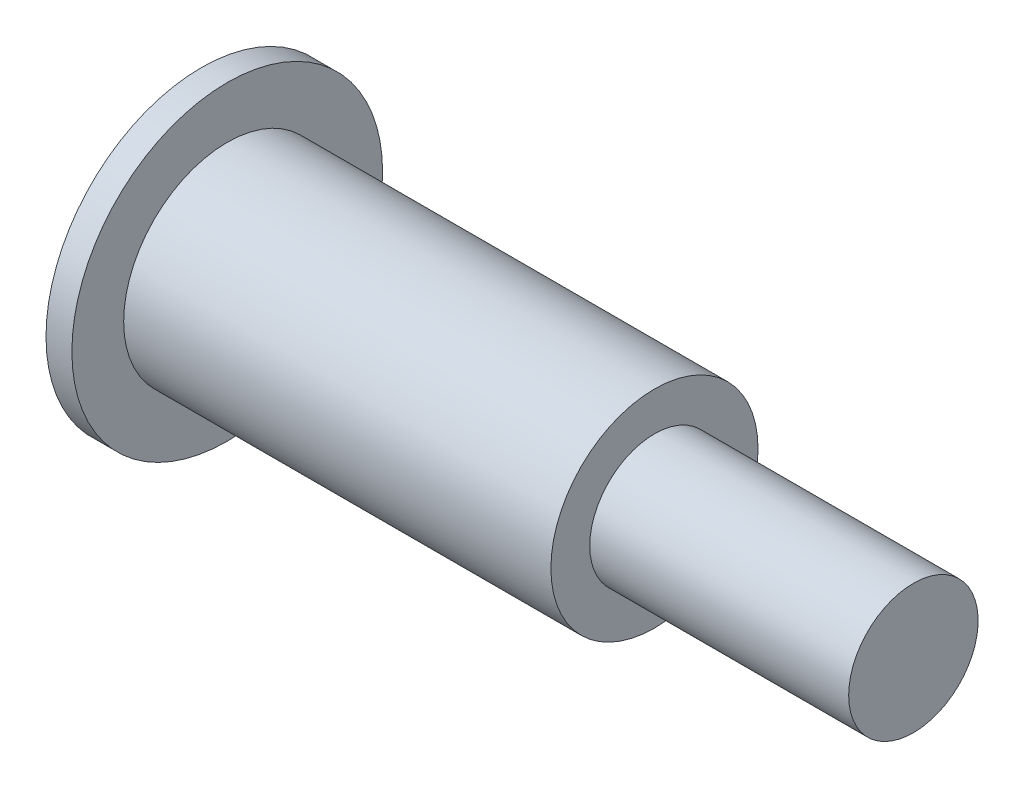
ISO-10303-21;
HEADER;
FILE_DESCRIPTION(('STEP AP214'),'2;1');
FILE_NAME('part.step','',(''),(''),'','','');
FILE_SCHEMA(('AUTOMOTIVE_DESIGN { 1 0 10303 214 1 1 1 1 }'));
ENDSEC;
DATA;
#1=APPLICATION_CONTEXT('core data for automotive mechanical design processes');
#2=APPLICATION_PROTOCOL_DEFINITION('international standard','automotive_design',2000,#1);
#3=PRODUCT_CONTEXT('',#1,'mechanical');
#4=PRODUCT('Part','Part','',(#3));
#5=PRODUCT_RELATED_PRODUCT_CATEGORY('part','',(#4));
#6=PRODUCT_DEFINITION_FORMATION('','',#4);
#7=PRODUCT_DEFINITION_CONTEXT('part definition',#1,'design');
#8=PRODUCT_DEFINITION('design','',#6,#7);
#9=PRODUCT_DEFINITION_SHAPE('','',#8);
#10=(LENGTH_UNIT() NAMED_UNIT(*) SI_UNIT(.MILLI.,.METRE.));
#11=(NAMED_UNIT(*) PLANE_ANGLE_UNIT() SI_UNIT($,.RADIAN.));
#12=(NAMED_UNIT(*) SI_UNIT($,.STERADIAN.) SOLID_ANGLE_UNIT());
#13=UNCERTAINTY_MEASURE_WITH_UNIT(LENGTH_MEASURE(1.E-05),#10,'distance_accuracy_value','');
#14=(GEOMETRIC_REPRESENTATION_CONTEXT(3) GLOBAL_UNCERTAINTY_ASSIGNED_CONTEXT((#13)) GLOBAL_UNIT_ASSIGNED_CONTEXT((#10,
#11,#12)) REPRESENTATION_CONTEXT('',''));
#15=CARTESIAN_POINT('',(0.,0.,0.));
#16=DIRECTION('',(0.,0.,1.));
#17=DIRECTION('',(1.,0.,0.));
#18=AXIS2_PLACEMENT_3D('',#15,#16,#17);
#19=CARTESIAN_POINT('',(0.,0.,0.));
#20=DIRECTION('',(1.,0.,0.));
#21=DIRECTION('',(0.,0.,-1.));
#22=AXIS2_PLACEMENT_3D('',#19,#20,#21);
#23=PLANE('',#22);
#24=CARTESIAN_POINT('',(0.,0.,0.));
#25=DIRECTION('',(-1.,0.,0.));
#26=DIRECTION('',(0.,0.,1.));
#27=AXIS2_PLACEMENT_3D('',#24,#25,#26);
#28=CIRCLE('',#27,6.);
#29=CARTESIAN_POINT('',(0.,0.,6.));
#30=VERTEX_POINT('',#29);
#31=EDGE_CURVE('E10',#30,#30,#28,.T.);
#32=ORIENTED_EDGE('',*,*,#31,.T.);
#33=EDGE_LOOP('',(#32));
#34=FACE_BOUND('',#33,.T.);
#35=ADVANCED_FACE('F28',(#34),#23,.F.);
#36=CARTESIAN_POINT('',(0.,0.,0.));
#37=DIRECTION('',(-1.,0.,0.));
#38=DIRECTION('',(0.,0.,1.));
#39=AXIS2_PLACEMENT_3D('',#36,#37,#38);
#40=CYLINDRICAL_SURFACE('',#39,6.);
#41=ORIENTED_EDGE('',*,*,#31,.F.);
#42=EDGE_LOOP('',(#41));
#43=FACE_BOUND('',#42,.T.);
#44=CARTESIAN_POINT('',(1.,0.,0.));
#45=DIRECTION('',(-1.,0.,0.));
#46=DIRECTION('',(0.,0.,1.));
#47=AXIS2_PLACEMENT_3D('',#44,#45,#46);
#48=CIRCLE('',#47,6.);
#49=CARTESIAN_POINT('',(1.,0.,6.));
#50=VERTEX_POINT('',#49);
#51=EDGE_CURVE('E34',#50,#50,#48,.T.);
#52=ORIENTED_EDGE('',*,*,#51,.T.);
#53=EDGE_LOOP('',(#52));
#54=FACE_BOUND('',#53,.T.);
#55=ADVANCED_FACE('F66',(#43,#54),#40,.T.);
#56=CARTESIAN_POINT('',(1.,6.,0.));
#57=DIRECTION('',(-1.,0.,0.));
#58=DIRECTION('',(0.,0.,1.));
#59=AXIS2_PLACEMENT_3D('',#56,#57,#58);
#60=PLANE('',#59);
#61=ORIENTED_EDGE('',*,*,#51,.F.);
#62=EDGE_LOOP('',(#61));
#63=FACE_BOUND('',#62,.T.);
#64=CARTESIAN_POINT('',(1.,0.,0.));
#65=DIRECTION('',(-1.,0.,0.));
#66=DIRECTION('',(0.,0.,1.));
#67=AXIS2_PLACEMENT_3D('',#64,#65,#66);
#68=CIRCLE('',#67,4.);
#69=CARTESIAN_POINT('',(1.,0.,4.));
#70=VERTEX_POINT('',#69);
#71=EDGE_CURVE('E38',#70,#70,#68,.T.);
#72=ORIENTED_EDGE('',*,*,#71,.T.);
#73=EDGE_LOOP('',(#72));
#74=FACE_BOUND('',#73,.T.);
#75=ADVANCED_FACE('F70',(#63,#74),#60,.F.);
#76=CARTESIAN_POINT('',(0.,0.,0.));
#77=DIRECTION('',(-1.,0.,0.));
#78=DIRECTION('',(0.,0.,1.));
#79=AXIS2_PLACEMENT_3D('',#76,#77,#78);
#80=CYLINDRICAL_SURFACE('',#79,4.);
#81=ORIENTED_EDGE('',*,*,#71,.F.);
#82=EDGE_LOOP('',(#81));
#83=FACE_BOUND('',#82,.T.);
#84=CARTESIAN_POINT('',(17.5,0.,0.));
#85=DIRECTION('',(-1.,0.,0.));
#86=DIRECTION('',(0.,0.,1.));
#87=AXIS2_PLACEMENT_3D('',#84,#85,#86);
#88=CIRCLE('',#87,4.);
#89=CARTESIAN_POINT('',(17.5,0.,4.));
#90=VERTEX_POINT('',#89);
#91=EDGE_CURVE('E42',#90,#90,#88,.T.);
#92=ORIENTED_EDGE('',*,*,#91,.T.);
#93=EDGE_LOOP('',(#92));
#94=FACE_BOUND('',#93,.T.);
#95=ADVANCED_FACE('F75',(#83,#94),#80,.T.);
#96=CARTESIAN_POINT('',(17.5,4.,0.));
#97=DIRECTION('',(-1.,0.,0.));
#98=DIRECTION('',(0.,0.,1.));
#99=AXIS2_PLACEMENT_3D('',#96,#97,#98);
#100=PLANE('',#99);
#101=ORIENTED_EDGE('',*,*,#91,.F.);
#102=EDGE_LOOP('',(#101));
#103=FACE_BOUND('',#102,.T.);
#104=CARTESIAN_POINT('',(17.5,0.,0.));
#105=DIRECTION('',(-1.,0.,0.));
#106=DIRECTION('',(0.,0.,1.));
#107=AXIS2_PLACEMENT_3D('',#104,#105,#106);
#108=CIRCLE('',#107,2.5);
#109=CARTESIAN_POINT('',(17.5,0.,2.5));
#110=VERTEX_POINT('',#109);
#111=EDGE_CURVE('E47',#110,#110,#108,.T.);
#112=ORIENTED_EDGE('',*,*,#111,.T.);
#113=EDGE_LOOP('',(#112));
#114=FACE_BOUND('',#113,.T.);
#115=ADVANCED_FACE('F62',(#103,#114),#100,.F.);
#116=CARTESIAN_POINT('',(0.,0.,0.));
#117=DIRECTION('',(-1.,0.,0.));
#118=DIRECTION('',(0.,0.,1.));
#119=AXIS2_PLACEMENT_3D('',#116,#117,#118);
#120=CYLINDRICAL_SURFACE('',#119,2.5);
#121=ORIENTED_EDGE('',*,*,#111,.F.);
#122=EDGE_LOOP('',(#121));
#123=FACE_BOUND('',#122,.T.);
#124=CARTESIAN_POINT('',(27.5,0.,0.));
#125=DIRECTION('',(-1.,0.,0.));
#126=DIRECTION('',(0.,0.,1.));
#127=AXIS2_PLACEMENT_3D('',#124,#125,#126);
#128=CIRCLE('',#127,2.5);
#129=CARTESIAN_POINT('',(27.5,0.,2.5));
#130=VERTEX_POINT('',#129);
#131=EDGE_CURVE('E50',#130,#130,#128,.T.);
#132=ORIENTED_EDGE('',*,*,#131,.T.);
#133=EDGE_LOOP('',(#132));
#134=FACE_BOUND('',#133,.T.);
#135=ADVANCED_FACE('F54',(#123,#134),#120,.T.);
#136=CARTESIAN_POINT('',(27.5,2.5,0.));
#137=DIRECTION('',(-1.,0.,0.));
#138=DIRECTION('',(0.,0.,1.));
#139=AXIS2_PLACEMENT_3D('',#136,#137,#138);
#140=PLANE('',#139);
#141=ORIENTED_EDGE('',*,*,#131,.F.);
#142=EDGE_LOOP('',(#141));
#143=FACE_BOUND('',#142,.T.);
#144=ADVANCED_FACE('F56',(#143),#140,.F.);
#145=CLOSED_SHELL('',(#35,#55,#75,#95,#115,#135,#144));
#146=MANIFOLD_SOLID_BREP('B2',#145);
#147=ADVANCED_BREP_SHAPE_REPRESENTATION('',(#18,#146),#14);
#148=SHAPE_DEFINITION_REPRESENTATION(#9,#147);
ENDSEC;
END-ISO-10303-21;
